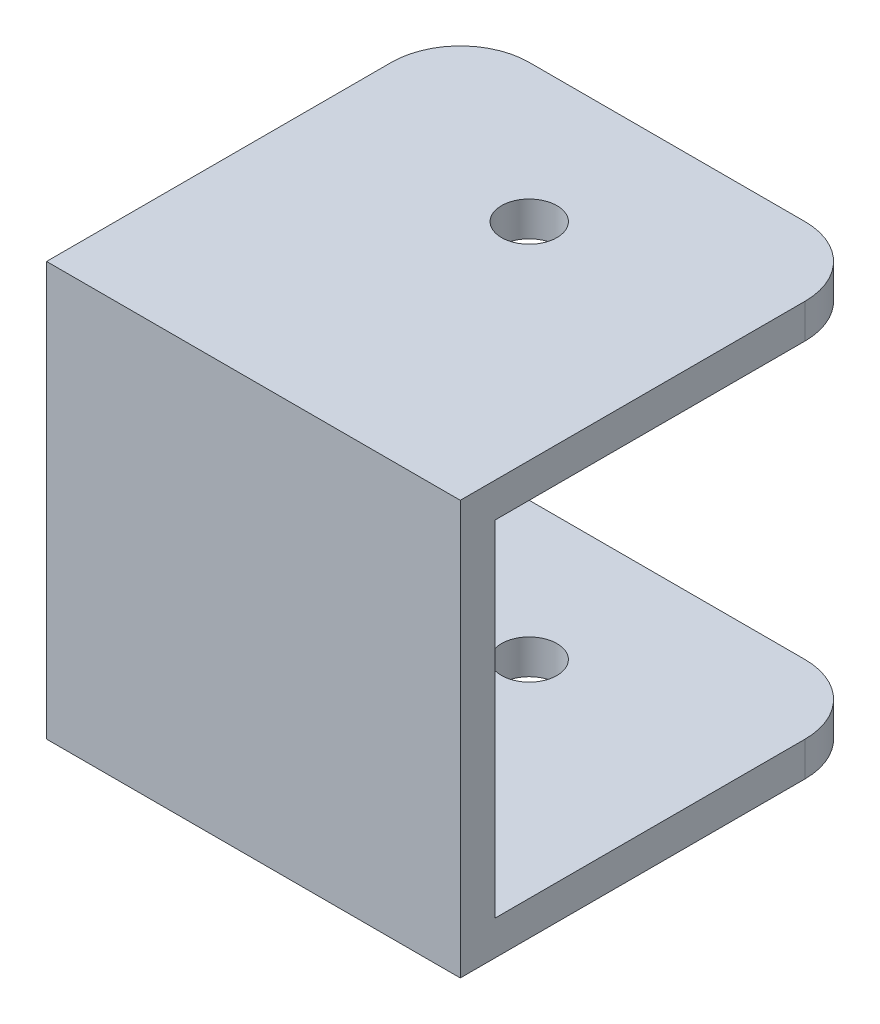
ISO-10303-21;
HEADER;
FILE_DESCRIPTION(('STEP AP214'),'2;1');
FILE_NAME('part.step','',(''),(''),'','','');
FILE_SCHEMA(('AUTOMOTIVE_DESIGN { 1 0 10303 214 1 1 1 1 }'));
ENDSEC;
DATA;
#1=APPLICATION_CONTEXT('core data for automotive mechanical design processes');
#2=APPLICATION_PROTOCOL_DEFINITION('international standard','automotive_design',2000,#1);
#3=PRODUCT_CONTEXT('',#1,'mechanical');
#4=PRODUCT('Part','Part','',(#3));
#5=PRODUCT_RELATED_PRODUCT_CATEGORY('part','',(#4));
#6=PRODUCT_DEFINITION_FORMATION('','',#4);
#7=PRODUCT_DEFINITION_CONTEXT('part definition',#1,'design');
#8=PRODUCT_DEFINITION('design','',#6,#7);
#9=PRODUCT_DEFINITION_SHAPE('','',#8);
#10=(LENGTH_UNIT() NAMED_UNIT(*) SI_UNIT(.MILLI.,.METRE.));
#11=(NAMED_UNIT(*) PLANE_ANGLE_UNIT() SI_UNIT($,.RADIAN.));
#12=(NAMED_UNIT(*) SI_UNIT($,.STERADIAN.) SOLID_ANGLE_UNIT());
#13=UNCERTAINTY_MEASURE_WITH_UNIT(LENGTH_MEASURE(1.E-05),#10,'distance_accuracy_value','');
#14=(GEOMETRIC_REPRESENTATION_CONTEXT(3) GLOBAL_UNCERTAINTY_ASSIGNED_CONTEXT((#13)) GLOBAL_UNIT_ASSIGNED_CONTEXT((#10,
#11,#12)) REPRESENTATION_CONTEXT('',''));
#15=CARTESIAN_POINT('',(0.,0.,0.));
#16=DIRECTION('',(0.,0.,1.));
#17=DIRECTION('',(1.,0.,0.));
#18=AXIS2_PLACEMENT_3D('',#15,#16,#17);
#19=CARTESIAN_POINT('',(-19.05,-19.05,-38.1));
#20=DIRECTION('',(0.,0.,-1.));
#21=DIRECTION('',(-1.,0.,0.));
#22=AXIS2_PLACEMENT_3D('',#19,#20,#21);
#23=PLANE('',#22);
#24=DIRECTION('',(1.,0.,0.));
#25=VECTOR('',#24,1.);
#26=CARTESIAN_POINT('',(-19.05,-19.05,-38.1));
#27=LINE('',#26,#25);
#28=CARTESIAN_POINT('',(-12.7,-19.05,-38.1));
#29=VERTEX_POINT('',#28);
#30=CARTESIAN_POINT('',(12.7,-19.05,-38.1));
#31=VERTEX_POINT('',#30);
#32=EDGE_CURVE('E173',#29,#31,#27,.T.);
#33=ORIENTED_EDGE('',*,*,#32,.F.);
#34=DIRECTION('',(0.,-1.,0.));
#35=VECTOR('',#34,1.);
#36=CARTESIAN_POINT('',(-12.7,68.71716,-38.1));
#37=LINE('',#36,#35);
#38=CARTESIAN_POINT('',(-12.7,-15.875,-38.1));
#39=VERTEX_POINT('',#38);
#40=EDGE_CURVE('E115',#39,#29,#37,.T.);
#41=ORIENTED_EDGE('',*,*,#40,.F.);
#42=DIRECTION('',(1.,0.,0.));
#43=VECTOR('',#42,1.);
#44=CARTESIAN_POINT('',(-19.05,-15.875,-38.1));
#45=LINE('',#44,#43);
#46=CARTESIAN_POINT('',(12.7,-15.875,-38.1));
#47=VERTEX_POINT('',#46);
#48=EDGE_CURVE('E114',#47,#39,#45,.F.);
#49=ORIENTED_EDGE('',*,*,#48,.F.);
#50=DIRECTION('',(0.,1.,0.));
#51=VECTOR('',#50,1.);
#52=CARTESIAN_POINT('',(12.7,-68.71716,-38.1));
#53=LINE('',#52,#51);
#54=EDGE_CURVE('E110',#31,#47,#53,.T.);
#55=ORIENTED_EDGE('',*,*,#54,.F.);
#56=EDGE_LOOP('',(#33,#41,#49,#55));
#57=FACE_BOUND('',#56,.T.);
#58=ADVANCED_FACE('F17',(#57),#23,.T.);
#59=CARTESIAN_POINT('',(0.,-19.05,-25.4));
#60=DIRECTION('',(0.,1.,0.));
#61=DIRECTION('',(0.,0.,1.));
#62=AXIS2_PLACEMENT_3D('',#59,#60,#61);
#63=CYLINDRICAL_SURFACE('',#62,2.5527);
#64=CARTESIAN_POINT('',(0.,-15.875,-25.4));
#65=DIRECTION('',(0.,1.,0.));
#66=DIRECTION('',(0.,0.,1.));
#67=AXIS2_PLACEMENT_3D('',#64,#65,#66);
#68=CIRCLE('',#67,2.5527);
#69=CARTESIAN_POINT('',(0.,-15.875,-22.8473));
#70=VERTEX_POINT('',#69);
#71=EDGE_CURVE('E183',#70,#70,#68,.F.);
#72=ORIENTED_EDGE('',*,*,#71,.F.);
#73=EDGE_LOOP('',(#72));
#74=FACE_BOUND('',#73,.T.);
#75=CARTESIAN_POINT('',(0.,-19.05,-25.4));
#76=DIRECTION('',(0.,1.,0.));
#77=DIRECTION('',(0.,0.,1.));
#78=AXIS2_PLACEMENT_3D('',#75,#76,#77);
#79=CIRCLE('',#78,2.5527);
#80=CARTESIAN_POINT('',(0.,-19.05,-22.8473));
#81=VERTEX_POINT('',#80);
#82=EDGE_CURVE('E125',#81,#81,#79,.T.);
#83=ORIENTED_EDGE('',*,*,#82,.F.);
#84=EDGE_LOOP('',(#83));
#85=FACE_BOUND('',#84,.T.);
#86=ADVANCED_FACE('F313',(#74,#85),#63,.F.);
#87=CARTESIAN_POINT('',(12.7,-68.71716,-31.75));
#88=DIRECTION('',(0.,1.,0.));
#89=DIRECTION('',(0.,0.,1.));
#90=AXIS2_PLACEMENT_3D('',#87,#88,#89);
#91=CYLINDRICAL_SURFACE('',#90,6.35);
#92=ORIENTED_EDGE('',*,*,#54,.T.);
#93=CARTESIAN_POINT('',(12.7,-15.875,-31.75));
#94=DIRECTION('',(0.,1.,0.));
#95=DIRECTION('',(0.,0.,1.));
#96=AXIS2_PLACEMENT_3D('',#93,#94,#95);
#97=CIRCLE('',#96,6.35);
#98=CARTESIAN_POINT('',(19.05,-15.875,-31.75));
#99=VERTEX_POINT('',#98);
#100=EDGE_CURVE('E20',#99,#47,#97,.T.);
#101=ORIENTED_EDGE('',*,*,#100,.F.);
#102=DIRECTION('',(0.,1.,0.));
#103=VECTOR('',#102,1.);
#104=CARTESIAN_POINT('',(19.05,0.,-31.75));
#105=LINE('',#104,#103);
#106=CARTESIAN_POINT('',(19.05,-19.05,-31.75));
#107=VERTEX_POINT('',#106);
#108=EDGE_CURVE('E108',#107,#99,#105,.T.);
#109=ORIENTED_EDGE('',*,*,#108,.F.);
#110=CARTESIAN_POINT('',(12.7,-19.05,-31.75));
#111=DIRECTION('',(0.,1.,0.));
#112=DIRECTION('',(0.,0.,1.));
#113=AXIS2_PLACEMENT_3D('',#110,#111,#112);
#114=CIRCLE('',#113,6.35);
#115=EDGE_CURVE('E171',#31,#107,#114,.F.);
#116=ORIENTED_EDGE('',*,*,#115,.F.);
#117=EDGE_LOOP('',(#92,#101,#109,#116));
#118=FACE_BOUND('',#117,.T.);
#119=ADVANCED_FACE('F105',(#118),#91,.T.);
#120=CARTESIAN_POINT('',(-19.05,15.875,-38.1));
#121=DIRECTION('',(0.,0.,-1.));
#122=DIRECTION('',(-1.,0.,0.));
#123=AXIS2_PLACEMENT_3D('',#120,#121,#122);
#124=PLANE('',#123);
#125=DIRECTION('',(1.,0.,0.));
#126=VECTOR('',#125,1.);
#127=CARTESIAN_POINT('',(-19.05,19.05,-38.1));
#128=LINE('',#127,#126);
#129=CARTESIAN_POINT('',(12.7,19.05,-38.1));
#130=VERTEX_POINT('',#129);
#131=CARTESIAN_POINT('',(-12.7,19.05,-38.1));
#132=VERTEX_POINT('',#131);
#133=EDGE_CURVE('E130',#130,#132,#128,.F.);
#134=ORIENTED_EDGE('',*,*,#133,.F.);
#135=DIRECTION('',(0.,1.,0.));
#136=VECTOR('',#135,1.);
#137=CARTESIAN_POINT('',(12.7,-68.71716,-38.1));
#138=LINE('',#137,#136);
#139=CARTESIAN_POINT('',(12.7,15.875,-38.1));
#140=VERTEX_POINT('',#139);
#141=EDGE_CURVE('E155',#140,#130,#138,.T.);
#142=ORIENTED_EDGE('',*,*,#141,.F.);
#143=DIRECTION('',(1.,0.,0.));
#144=VECTOR('',#143,1.);
#145=CARTESIAN_POINT('',(-19.05,15.875,-38.1));
#146=LINE('',#145,#144);
#147=CARTESIAN_POINT('',(-12.7,15.875,-38.1));
#148=VERTEX_POINT('',#147);
#149=EDGE_CURVE('E182',#148,#140,#146,.T.);
#150=ORIENTED_EDGE('',*,*,#149,.F.);
#151=DIRECTION('',(0.,-1.,0.));
#152=VECTOR('',#151,1.);
#153=CARTESIAN_POINT('',(-12.7,68.71716,-38.1));
#154=LINE('',#153,#152);
#155=EDGE_CURVE('E138',#132,#148,#154,.T.);
#156=ORIENTED_EDGE('',*,*,#155,.F.);
#157=EDGE_LOOP('',(#134,#142,#150,#156));
#158=FACE_BOUND('',#157,.T.);
#159=ADVANCED_FACE('F259',(#158),#124,.T.);
#160=CARTESIAN_POINT('',(12.7,-68.71716,-31.75));
#161=DIRECTION('',(0.,1.,0.));
#162=DIRECTION('',(0.,0.,1.));
#163=AXIS2_PLACEMENT_3D('',#160,#161,#162);
#164=CYLINDRICAL_SURFACE('',#163,6.35);
#165=ORIENTED_EDGE('',*,*,#141,.T.);
#166=CARTESIAN_POINT('',(12.7,19.05,-31.75));
#167=DIRECTION('',(0.,1.,0.));
#168=DIRECTION('',(0.,0.,1.));
#169=AXIS2_PLACEMENT_3D('',#166,#167,#168);
#170=CIRCLE('',#169,6.35);
#171=CARTESIAN_POINT('',(19.05,19.05,-31.75));
#172=VERTEX_POINT('',#171);
#173=EDGE_CURVE('E161',#172,#130,#170,.T.);
#174=ORIENTED_EDGE('',*,*,#173,.F.);
#175=DIRECTION('',(0.,1.,0.));
#176=VECTOR('',#175,1.);
#177=CARTESIAN_POINT('',(19.05,0.,-31.75));
#178=LINE('',#177,#176);
#179=CARTESIAN_POINT('',(19.05,15.875,-31.75));
#180=VERTEX_POINT('',#179);
#181=EDGE_CURVE('E135',#180,#172,#178,.T.);
#182=ORIENTED_EDGE('',*,*,#181,.F.);
#183=CARTESIAN_POINT('',(12.7,15.875,-31.75));
#184=DIRECTION('',(0.,1.,0.));
#185=DIRECTION('',(0.,0.,1.));
#186=AXIS2_PLACEMENT_3D('',#183,#184,#185);
#187=CIRCLE('',#186,6.35);
#188=EDGE_CURVE('E180',#140,#180,#187,.F.);
#189=ORIENTED_EDGE('',*,*,#188,.F.);
#190=EDGE_LOOP('',(#165,#174,#182,#189));
#191=FACE_BOUND('',#190,.T.);
#192=ADVANCED_FACE('F257',(#191),#164,.T.);
#193=CARTESIAN_POINT('',(0.,-19.05,-25.4));
#194=DIRECTION('',(0.,1.,0.));
#195=DIRECTION('',(0.,0.,1.));
#196=AXIS2_PLACEMENT_3D('',#193,#194,#195);
#197=CYLINDRICAL_SURFACE('',#196,2.5527);
#198=CARTESIAN_POINT('',(0.,15.875,-25.4));
#199=DIRECTION('',(0.,1.,0.));
#200=DIRECTION('',(0.,0.,1.));
#201=AXIS2_PLACEMENT_3D('',#198,#199,#200);
#202=CIRCLE('',#201,2.5527);
#203=CARTESIAN_POINT('',(0.,15.875,-22.8473));
#204=VERTEX_POINT('',#203);
#205=EDGE_CURVE('E177',#204,#204,#202,.T.);
#206=ORIENTED_EDGE('',*,*,#205,.F.);
#207=EDGE_LOOP('',(#206));
#208=FACE_BOUND('',#207,.T.);
#209=CARTESIAN_POINT('',(0.,19.05,-25.4));
#210=DIRECTION('',(0.,1.,0.));
#211=DIRECTION('',(0.,0.,1.));
#212=AXIS2_PLACEMENT_3D('',#209,#210,#211);
#213=CIRCLE('',#212,2.5527);
#214=CARTESIAN_POINT('',(0.,19.05,-22.8473));
#215=VERTEX_POINT('',#214);
#216=EDGE_CURVE('E157',#215,#215,#213,.F.);
#217=ORIENTED_EDGE('',*,*,#216,.F.);
#218=EDGE_LOOP('',(#217));
#219=FACE_BOUND('',#218,.T.);
#220=ADVANCED_FACE('F304',(#208,#219),#197,.F.);
#221=CARTESIAN_POINT('',(-12.7,68.71716,-31.75));
#222=DIRECTION('',(0.,-1.,0.));
#223=DIRECTION('',(0.,0.,-1.));
#224=AXIS2_PLACEMENT_3D('',#221,#222,#223);
#225=CYLINDRICAL_SURFACE('',#224,6.35);
#226=ORIENTED_EDGE('',*,*,#40,.T.);
#227=CARTESIAN_POINT('',(-12.7,-19.05,-31.75));
#228=DIRECTION('',(0.,-1.,0.));
#229=DIRECTION('',(0.,0.,-1.));
#230=AXIS2_PLACEMENT_3D('',#227,#228,#229);
#231=CIRCLE('',#230,6.35);
#232=CARTESIAN_POINT('',(-19.05,-19.05,-31.75));
#233=VERTEX_POINT('',#232);
#234=EDGE_CURVE('E168',#233,#29,#231,.T.);
#235=ORIENTED_EDGE('',*,*,#234,.F.);
#236=DIRECTION('',(0.,1.,0.));
#237=VECTOR('',#236,1.);
#238=CARTESIAN_POINT('',(-19.05,0.,-31.75));
#239=LINE('',#238,#237);
#240=CARTESIAN_POINT('',(-19.05,-15.875,-31.75));
#241=VERTEX_POINT('',#240);
#242=EDGE_CURVE('E160',#233,#241,#239,.T.);
#243=ORIENTED_EDGE('',*,*,#242,.T.);
#244=CARTESIAN_POINT('',(-12.7,-15.875,-31.75));
#245=DIRECTION('',(0.,-1.,0.));
#246=DIRECTION('',(0.,0.,-1.));
#247=AXIS2_PLACEMENT_3D('',#244,#245,#246);
#248=CIRCLE('',#247,6.35);
#249=EDGE_CURVE('E185',#39,#241,#248,.F.);
#250=ORIENTED_EDGE('',*,*,#249,.F.);
#251=EDGE_LOOP('',(#226,#235,#243,#250));
#252=FACE_BOUND('',#251,.T.);
#253=ADVANCED_FACE('F300',(#252),#225,.T.);
#254=CARTESIAN_POINT('',(-19.05,-15.875,-38.1));
#255=DIRECTION('',(0.,1.,0.));
#256=DIRECTION('',(0.,0.,1.));
#257=AXIS2_PLACEMENT_3D('',#254,#255,#256);
#258=PLANE('',#257);
#259=ORIENTED_EDGE('',*,*,#71,.T.);
#260=EDGE_LOOP('',(#259));
#261=FACE_BOUND('',#260,.T.);
#262=ORIENTED_EDGE('',*,*,#48,.T.);
#263=ORIENTED_EDGE('',*,*,#249,.T.);
#264=DIRECTION('',(0.,0.,-1.));
#265=VECTOR('',#264,1.);
#266=CARTESIAN_POINT('',(-19.05,-15.875,0.));
#267=LINE('',#266,#265);
#268=CARTESIAN_POINT('',(-19.05,-15.875,-3.175));
#269=VERTEX_POINT('',#268);
#270=EDGE_CURVE('E237',#241,#269,#267,.F.);
#271=ORIENTED_EDGE('',*,*,#270,.T.);
#272=DIRECTION('',(-1.,0.,0.));
#273=VECTOR('',#272,1.);
#274=CARTESIAN_POINT('',(-19.05,-15.875,-3.175));
#275=LINE('',#274,#273);
#276=CARTESIAN_POINT('',(19.05,-15.875,-3.175));
#277=VERTEX_POINT('',#276);
#278=EDGE_CURVE('E120',#277,#269,#275,.T.);
#279=ORIENTED_EDGE('',*,*,#278,.F.);
#280=DIRECTION('',(0.,0.,-1.));
#281=VECTOR('',#280,1.);
#282=CARTESIAN_POINT('',(19.05,-15.875,0.));
#283=LINE('',#282,#281);
#284=EDGE_CURVE('E117',#99,#277,#283,.F.);
#285=ORIENTED_EDGE('',*,*,#284,.F.);
#286=ORIENTED_EDGE('',*,*,#100,.T.);
#287=EDGE_LOOP('',(#262,#263,#271,#279,#285,#286));
#288=FACE_BOUND('',#287,.T.);
#289=ADVANCED_FACE('F118',(#261,#288),#258,.T.);
#290=CARTESIAN_POINT('',(-19.05,-15.875,-3.175));
#291=DIRECTION('',(0.,0.,-1.));
#292=DIRECTION('',(-1.,0.,0.));
#293=AXIS2_PLACEMENT_3D('',#290,#291,#292);
#294=PLANE('',#293);
#295=ORIENTED_EDGE('',*,*,#278,.T.);
#296=DIRECTION('',(0.,1.,0.));
#297=VECTOR('',#296,1.);
#298=CARTESIAN_POINT('',(-19.05,0.,-3.175));
#299=LINE('',#298,#297);
#300=CARTESIAN_POINT('',(-19.05,15.875,-3.175));
#301=VERTEX_POINT('',#300);
#302=EDGE_CURVE('E226',#269,#301,#299,.T.);
#303=ORIENTED_EDGE('',*,*,#302,.T.);
#304=DIRECTION('',(1.,0.,0.));
#305=VECTOR('',#304,1.);
#306=CARTESIAN_POINT('',(-19.05,15.875,-3.175));
#307=LINE('',#306,#305);
#308=CARTESIAN_POINT('',(19.05,15.875,-3.175));
#309=VERTEX_POINT('',#308);
#310=EDGE_CURVE('E231',#309,#301,#307,.F.);
#311=ORIENTED_EDGE('',*,*,#310,.F.);
#312=DIRECTION('',(0.,1.,0.));
#313=VECTOR('',#312,1.);
#314=CARTESIAN_POINT('',(19.05,0.,-3.175));
#315=LINE('',#314,#313);
#316=EDGE_CURVE('E124',#277,#309,#315,.T.);
#317=ORIENTED_EDGE('',*,*,#316,.F.);
#318=EDGE_LOOP('',(#295,#303,#311,#317));
#319=FACE_BOUND('',#318,.T.);
#320=ADVANCED_FACE('F293',(#319),#294,.T.);
#321=CARTESIAN_POINT('',(-19.05,15.875,-3.175));
#322=DIRECTION('',(0.,-1.,0.));
#323=DIRECTION('',(0.,0.,-1.));
#324=AXIS2_PLACEMENT_3D('',#321,#322,#323);
#325=PLANE('',#324);
#326=ORIENTED_EDGE('',*,*,#205,.T.);
#327=EDGE_LOOP('',(#326));
#328=FACE_BOUND('',#327,.T.);
#329=ORIENTED_EDGE('',*,*,#149,.T.);
#330=ORIENTED_EDGE('',*,*,#188,.T.);
#331=DIRECTION('',(0.,0.,-1.));
#332=VECTOR('',#331,1.);
#333=CARTESIAN_POINT('',(19.05,15.875,0.));
#334=LINE('',#333,#332);
#335=EDGE_CURVE('E143',#309,#180,#334,.T.);
#336=ORIENTED_EDGE('',*,*,#335,.F.);
#337=ORIENTED_EDGE('',*,*,#310,.T.);
#338=DIRECTION('',(0.,0.,-1.));
#339=VECTOR('',#338,1.);
#340=CARTESIAN_POINT('',(-19.05,15.875,0.));
#341=LINE('',#340,#339);
#342=CARTESIAN_POINT('',(-19.05,15.875,-31.75));
#343=VERTEX_POINT('',#342);
#344=EDGE_CURVE('E219',#301,#343,#341,.T.);
#345=ORIENTED_EDGE('',*,*,#344,.T.);
#346=CARTESIAN_POINT('',(-12.7,15.875,-31.75));
#347=DIRECTION('',(0.,-1.,0.));
#348=DIRECTION('',(0.,0.,-1.));
#349=AXIS2_PLACEMENT_3D('',#346,#347,#348);
#350=CIRCLE('',#349,6.35);
#351=EDGE_CURVE('E174',#148,#343,#350,.F.);
#352=ORIENTED_EDGE('',*,*,#351,.F.);
#353=EDGE_LOOP('',(#329,#330,#336,#337,#345,#352));
#354=FACE_BOUND('',#353,.T.);
#355=ADVANCED_FACE('F290',(#328,#354),#325,.T.);
#356=CARTESIAN_POINT('',(-12.7,68.71716,-31.75));
#357=DIRECTION('',(0.,-1.,0.));
#358=DIRECTION('',(0.,0.,-1.));
#359=AXIS2_PLACEMENT_3D('',#356,#357,#358);
#360=CYLINDRICAL_SURFACE('',#359,6.35);
#361=ORIENTED_EDGE('',*,*,#155,.T.);
#362=ORIENTED_EDGE('',*,*,#351,.T.);
#363=DIRECTION('',(0.,1.,0.));
#364=VECTOR('',#363,1.);
#365=CARTESIAN_POINT('',(-19.05,0.,-31.75));
#366=LINE('',#365,#364);
#367=CARTESIAN_POINT('',(-19.05,19.05,-31.75));
#368=VERTEX_POINT('',#367);
#369=EDGE_CURVE('E217',#343,#368,#366,.T.);
#370=ORIENTED_EDGE('',*,*,#369,.T.);
#371=CARTESIAN_POINT('',(-12.7,19.05,-31.75));
#372=DIRECTION('',(0.,-1.,0.));
#373=DIRECTION('',(0.,0.,-1.));
#374=AXIS2_PLACEMENT_3D('',#371,#372,#373);
#375=CIRCLE('',#374,6.35);
#376=EDGE_CURVE('E133',#132,#368,#375,.F.);
#377=ORIENTED_EDGE('',*,*,#376,.F.);
#378=EDGE_LOOP('',(#361,#362,#370,#377));
#379=FACE_BOUND('',#378,.T.);
#380=ADVANCED_FACE('F286',(#379),#360,.T.);
#381=CARTESIAN_POINT('',(-19.05,-19.05,0.));
#382=DIRECTION('',(0.,-1.,0.));
#383=DIRECTION('',(0.,0.,-1.));
#384=AXIS2_PLACEMENT_3D('',#381,#382,#383);
#385=PLANE('',#384);
#386=ORIENTED_EDGE('',*,*,#82,.T.);
#387=EDGE_LOOP('',(#386));
#388=FACE_BOUND('',#387,.T.);
#389=DIRECTION('',(0.,0.,-1.));
#390=VECTOR('',#389,1.);
#391=CARTESIAN_POINT('',(-19.05,-19.05,0.));
#392=LINE('',#391,#390);
#393=CARTESIAN_POINT('',(-19.05,-19.05,0.));
#394=VERTEX_POINT('',#393);
#395=EDGE_CURVE('E205',#394,#233,#392,.T.);
#396=ORIENTED_EDGE('',*,*,#395,.T.);
#397=ORIENTED_EDGE('',*,*,#234,.T.);
#398=ORIENTED_EDGE('',*,*,#32,.T.);
#399=ORIENTED_EDGE('',*,*,#115,.T.);
#400=DIRECTION('',(0.,0.,-1.));
#401=VECTOR('',#400,1.);
#402=CARTESIAN_POINT('',(19.05,-19.05,0.));
#403=LINE('',#402,#401);
#404=CARTESIAN_POINT('',(19.05,-19.05,0.));
#405=VERTEX_POINT('',#404);
#406=EDGE_CURVE('E129',#405,#107,#403,.T.);
#407=ORIENTED_EDGE('',*,*,#406,.F.);
#408=DIRECTION('',(1.,0.,0.));
#409=VECTOR('',#408,1.);
#410=CARTESIAN_POINT('',(-19.05,-19.05,0.));
#411=LINE('',#410,#409);
#412=EDGE_CURVE('E199',#394,#405,#411,.T.);
#413=ORIENTED_EDGE('',*,*,#412,.F.);
#414=EDGE_LOOP('',(#396,#397,#398,#399,#407,#413));
#415=FACE_BOUND('',#414,.T.);
#416=ADVANCED_FACE('F283',(#388,#415),#385,.T.);
#417=CARTESIAN_POINT('',(19.05,0.,0.));
#418=DIRECTION('',(1.,0.,0.));
#419=DIRECTION('',(0.,0.,-1.));
#420=AXIS2_PLACEMENT_3D('',#417,#418,#419);
#421=PLANE('',#420);
#422=ORIENTED_EDGE('',*,*,#406,.T.);
#423=ORIENTED_EDGE('',*,*,#108,.T.);
#424=ORIENTED_EDGE('',*,*,#284,.T.);
#425=ORIENTED_EDGE('',*,*,#316,.T.);
#426=ORIENTED_EDGE('',*,*,#335,.T.);
#427=ORIENTED_EDGE('',*,*,#181,.T.);
#428=DIRECTION('',(0.,0.,1.));
#429=VECTOR('',#428,1.);
#430=CARTESIAN_POINT('',(19.05,19.05,-38.1));
#431=LINE('',#430,#429);
#432=CARTESIAN_POINT('',(19.05,19.05,0.));
#433=VERTEX_POINT('',#432);
#434=EDGE_CURVE('E164',#433,#172,#431,.F.);
#435=ORIENTED_EDGE('',*,*,#434,.F.);
#436=DIRECTION('',(0.,1.,0.));
#437=VECTOR('',#436,1.);
#438=CARTESIAN_POINT('',(19.05,19.05,0.));
#439=LINE('',#438,#437);
#440=EDGE_CURVE('E197',#405,#433,#439,.T.);
#441=ORIENTED_EDGE('',*,*,#440,.F.);
#442=EDGE_LOOP('',(#422,#423,#424,#425,#426,#427,#435,#441));
#443=FACE_BOUND('',#442,.T.);
#444=ADVANCED_FACE('F127',(#443),#421,.T.);
#445=CARTESIAN_POINT('',(-19.05,19.05,-38.1));
#446=DIRECTION('',(0.,1.,0.));
#447=DIRECTION('',(0.,0.,1.));
#448=AXIS2_PLACEMENT_3D('',#445,#446,#447);
#449=PLANE('',#448);
#450=ORIENTED_EDGE('',*,*,#216,.T.);
#451=EDGE_LOOP('',(#450));
#452=FACE_BOUND('',#451,.T.);
#453=ORIENTED_EDGE('',*,*,#434,.T.);
#454=ORIENTED_EDGE('',*,*,#173,.T.);
#455=ORIENTED_EDGE('',*,*,#133,.T.);
#456=ORIENTED_EDGE('',*,*,#376,.T.);
#457=DIRECTION('',(0.,0.,-1.));
#458=VECTOR('',#457,1.);
#459=CARTESIAN_POINT('',(-19.05,19.05,0.));
#460=LINE('',#459,#458);
#461=CARTESIAN_POINT('',(-19.05,19.05,0.));
#462=VERTEX_POINT('',#461);
#463=EDGE_CURVE('E35',#368,#462,#460,.F.);
#464=ORIENTED_EDGE('',*,*,#463,.T.);
#465=DIRECTION('',(1.,0.,0.));
#466=VECTOR('',#465,1.);
#467=CARTESIAN_POINT('',(-19.05,19.05,0.));
#468=LINE('',#467,#466);
#469=EDGE_CURVE('E26',#433,#462,#468,.F.);
#470=ORIENTED_EDGE('',*,*,#469,.F.);
#471=EDGE_LOOP('',(#453,#454,#455,#456,#464,#470));
#472=FACE_BOUND('',#471,.T.);
#473=ADVANCED_FACE('F251',(#452,#472),#449,.T.);
#474=CARTESIAN_POINT('',(-19.05,0.,0.));
#475=DIRECTION('',(1.,0.,0.));
#476=DIRECTION('',(0.,0.,-1.));
#477=AXIS2_PLACEMENT_3D('',#474,#475,#476);
#478=PLANE('',#477);
#479=DIRECTION('',(0.,1.,0.));
#480=VECTOR('',#479,1.);
#481=CARTESIAN_POINT('',(-19.05,19.05,0.));
#482=LINE('',#481,#480);
#483=EDGE_CURVE('E11',#462,#394,#482,.F.);
#484=ORIENTED_EDGE('',*,*,#483,.F.);
#485=ORIENTED_EDGE('',*,*,#463,.F.);
#486=ORIENTED_EDGE('',*,*,#369,.F.);
#487=ORIENTED_EDGE('',*,*,#344,.F.);
#488=ORIENTED_EDGE('',*,*,#302,.F.);
#489=ORIENTED_EDGE('',*,*,#270,.F.);
#490=ORIENTED_EDGE('',*,*,#242,.F.);
#491=ORIENTED_EDGE('',*,*,#395,.F.);
#492=EDGE_LOOP('',(#484,#485,#486,#487,#488,#489,#490,#491));
#493=FACE_BOUND('',#492,.T.);
#494=ADVANCED_FACE('F266',(#493),#478,.F.);
#495=CARTESIAN_POINT('',(-19.05,19.05,0.));
#496=DIRECTION('',(0.,0.,1.));
#497=DIRECTION('',(1.,0.,0.));
#498=AXIS2_PLACEMENT_3D('',#495,#496,#497);
#499=PLANE('',#498);
#500=ORIENTED_EDGE('',*,*,#469,.T.);
#501=ORIENTED_EDGE('',*,*,#483,.T.);
#502=ORIENTED_EDGE('',*,*,#412,.T.);
#503=ORIENTED_EDGE('',*,*,#440,.T.);
#504=EDGE_LOOP('',(#500,#501,#502,#503));
#505=FACE_BOUND('',#504,.T.);
#506=ADVANCED_FACE('F269',(#505),#499,.T.);
#507=CLOSED_SHELL('',(#58,#86,#119,#159,#192,#220,#253,#289,#320,#355,#380,#416,#444,#473,#494,#506));
#508=MANIFOLD_SOLID_BREP('B1',#507);
#509=ADVANCED_BREP_SHAPE_REPRESENTATION('',(#18,#508),#14);
#510=SHAPE_DEFINITION_REPRESENTATION(#9,#509);
ENDSEC;
END-ISO-10303-21;
